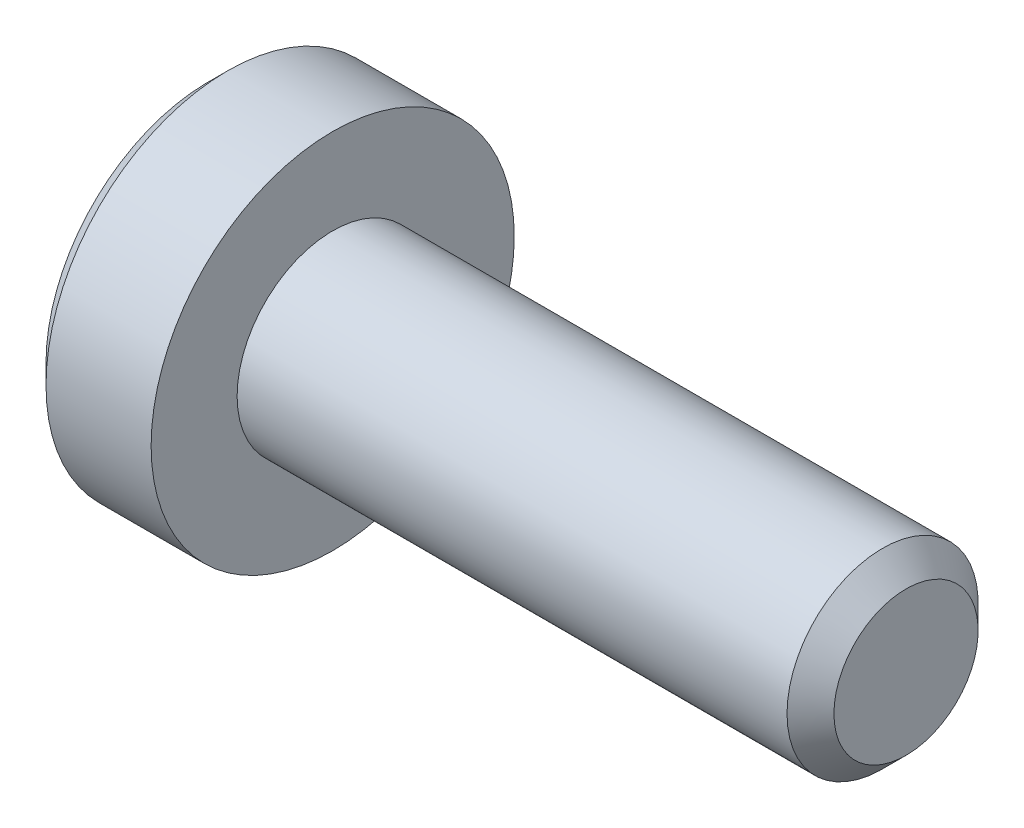
ISO-10303-21;
HEADER;
FILE_DESCRIPTION(('STEP AP214'),'2;1');
FILE_NAME('part.step','',(''),(''),'','','');
FILE_SCHEMA(('AUTOMOTIVE_DESIGN { 1 0 10303 214 1 1 1 1 }'));
ENDSEC;
DATA;
#1=APPLICATION_CONTEXT('core data for automotive mechanical design processes');
#2=APPLICATION_PROTOCOL_DEFINITION('international standard','automotive_design',2000,#1);
#3=PRODUCT_CONTEXT('',#1,'mechanical');
#4=PRODUCT('Part','Part','',(#3));
#5=PRODUCT_RELATED_PRODUCT_CATEGORY('part','',(#4));
#6=PRODUCT_DEFINITION_FORMATION('','',#4);
#7=PRODUCT_DEFINITION_CONTEXT('part definition',#1,'design');
#8=PRODUCT_DEFINITION('design','',#6,#7);
#9=PRODUCT_DEFINITION_SHAPE('','',#8);
#10=(LENGTH_UNIT() NAMED_UNIT(*) SI_UNIT(.MILLI.,.METRE.));
#11=(NAMED_UNIT(*) PLANE_ANGLE_UNIT() SI_UNIT($,.RADIAN.));
#12=(NAMED_UNIT(*) SI_UNIT($,.STERADIAN.) SOLID_ANGLE_UNIT());
#13=UNCERTAINTY_MEASURE_WITH_UNIT(LENGTH_MEASURE(1.E-05),#10,'distance_accuracy_value','');
#14=(GEOMETRIC_REPRESENTATION_CONTEXT(3) GLOBAL_UNCERTAINTY_ASSIGNED_CONTEXT((#13)) GLOBAL_UNIT_ASSIGNED_CONTEXT((#10,
#11,#12)) REPRESENTATION_CONTEXT('',''));
#15=CARTESIAN_POINT('',(0.,0.,0.));
#16=DIRECTION('',(0.,0.,1.));
#17=DIRECTION('',(1.,0.,0.));
#18=AXIS2_PLACEMENT_3D('',#15,#16,#17);
#19=CARTESIAN_POINT('',(-1.3,0.,0.));
#20=DIRECTION('',(1.,0.,0.));
#21=DIRECTION('',(0.,0.,-1.));
#22=AXIS2_PLACEMENT_3D('',#19,#20,#21);
#23=PLANE('',#22);
#24=CARTESIAN_POINT('',(-1.3,0.,0.));
#25=DIRECTION('',(-1.,0.,0.));
#26=DIRECTION('',(0.,0.,1.));
#27=AXIS2_PLACEMENT_3D('',#24,#25,#26);
#28=CIRCLE('',#27,1.7);
#29=CARTESIAN_POINT('',(-1.3,0.,1.7));
#30=VERTEX_POINT('',#29);
#31=EDGE_CURVE('E11',#30,#30,#28,.T.);
#32=ORIENTED_EDGE('',*,*,#31,.T.);
#33=EDGE_LOOP('',(#32));
#34=FACE_BOUND('',#33,.T.);
#35=DIRECTION('',(0.,-1.,0.));
#36=VECTOR('',#35,1.);
#37=CARTESIAN_POINT('',(-1.3,0.37527767497326,0.65));
#38=LINE('',#37,#36);
#39=CARTESIAN_POINT('',(-1.3,0.37527767497326,0.65));
#40=VERTEX_POINT('',#39);
#41=CARTESIAN_POINT('',(-1.3,-0.37527767497326,0.65));
#42=VERTEX_POINT('',#41);
#43=EDGE_CURVE('E49',#40,#42,#38,.T.);
#44=ORIENTED_EDGE('',*,*,#43,.T.);
#45=DIRECTION('',(0.,-0.499999999999993,-0.866025403784442));
#46=VECTOR('',#45,1.);
#47=CARTESIAN_POINT('',(-1.3,-0.37527767497326,0.65));
#48=LINE('',#47,#46);
#49=CARTESIAN_POINT('',(-1.3,-0.75055534994651,0.));
#50=VERTEX_POINT('',#49);
#51=EDGE_CURVE('E120',#42,#50,#48,.T.);
#52=ORIENTED_EDGE('',*,*,#51,.T.);
#53=DIRECTION('',(0.,0.499999999999993,-0.866025403784442));
#54=VECTOR('',#53,1.);
#55=CARTESIAN_POINT('',(-1.3,-0.75055534994651,0.));
#56=LINE('',#55,#54);
#57=CARTESIAN_POINT('',(-1.3,-0.37527767497326,-0.65));
#58=VERTEX_POINT('',#57);
#59=EDGE_CURVE('E123',#50,#58,#56,.T.);
#60=ORIENTED_EDGE('',*,*,#59,.T.);
#61=DIRECTION('',(0.,1.,0.));
#62=VECTOR('',#61,1.);
#63=CARTESIAN_POINT('',(-1.3,-0.37527767497326,-0.65));
#64=LINE('',#63,#62);
#65=CARTESIAN_POINT('',(-1.3,0.37527767497326,-0.65));
#66=VERTEX_POINT('',#65);
#67=EDGE_CURVE('E126',#58,#66,#64,.T.);
#68=ORIENTED_EDGE('',*,*,#67,.T.);
#69=DIRECTION('',(0.,0.499999999999993,0.866025403784442));
#70=VECTOR('',#69,1.);
#71=CARTESIAN_POINT('',(-1.3,0.37527767497326,-0.65));
#72=LINE('',#71,#70);
#73=CARTESIAN_POINT('',(-1.3,0.75055534994651,0.));
#74=VERTEX_POINT('',#73);
#75=EDGE_CURVE('E110',#66,#74,#72,.T.);
#76=ORIENTED_EDGE('',*,*,#75,.T.);
#77=DIRECTION('',(0.,-0.499999999999993,0.866025403784442));
#78=VECTOR('',#77,1.);
#79=CARTESIAN_POINT('',(-1.3,0.75055534994651,0.));
#80=LINE('',#79,#78);
#81=EDGE_CURVE('E129',#74,#40,#80,.T.);
#82=ORIENTED_EDGE('',*,*,#81,.T.);
#83=EDGE_LOOP('',(#44,#52,#60,#68,#76,#82));
#84=FACE_BOUND('',#83,.T.);
#85=ADVANCED_FACE('F35',(#34,#84),#23,.F.);
#86=CARTESIAN_POINT('',(-1.1,0.,0.));
#87=DIRECTION('',(1.,0.,0.));
#88=DIRECTION('',(0.,0.,-1.));
#89=AXIS2_PLACEMENT_3D('',#86,#87,#88);
#90=CONICAL_SURFACE('',#89,1.9,0.785398163397449);
#91=ORIENTED_EDGE('',*,*,#31,.F.);
#92=EDGE_LOOP('',(#91));
#93=FACE_BOUND('',#92,.T.);
#94=CARTESIAN_POINT('',(-1.1,0.,0.));
#95=DIRECTION('',(-1.,0.,0.));
#96=DIRECTION('',(0.,0.,1.));
#97=AXIS2_PLACEMENT_3D('',#94,#95,#96);
#98=CIRCLE('',#97,1.9);
#99=CARTESIAN_POINT('',(-1.1,0.,1.9));
#100=VERTEX_POINT('',#99);
#101=EDGE_CURVE('E42',#100,#100,#98,.T.);
#102=ORIENTED_EDGE('',*,*,#101,.T.);
#103=EDGE_LOOP('',(#102));
#104=FACE_BOUND('',#103,.T.);
#105=ADVANCED_FACE('F154',(#93,#104),#90,.T.);
#106=CARTESIAN_POINT('',(6.,0.,0.));
#107=DIRECTION('',(-1.,0.,0.));
#108=DIRECTION('',(0.,0.,1.));
#109=AXIS2_PLACEMENT_3D('',#106,#107,#108);
#110=CYLINDRICAL_SURFACE('',#109,1.9);
#111=ORIENTED_EDGE('',*,*,#101,.F.);
#112=EDGE_LOOP('',(#111));
#113=FACE_BOUND('',#112,.T.);
#114=CARTESIAN_POINT('',(0.,0.,0.));
#115=DIRECTION('',(-1.,0.,0.));
#116=DIRECTION('',(0.,0.,1.));
#117=AXIS2_PLACEMENT_3D('',#114,#115,#116);
#118=CIRCLE('',#117,1.9);
#119=CARTESIAN_POINT('',(0.,0.,1.9));
#120=VERTEX_POINT('',#119);
#121=EDGE_CURVE('E149',#120,#120,#118,.T.);
#122=ORIENTED_EDGE('',*,*,#121,.T.);
#123=EDGE_LOOP('',(#122));
#124=FACE_BOUND('',#123,.T.);
#125=ADVANCED_FACE('F156',(#113,#124),#110,.T.);
#126=CARTESIAN_POINT('',(0.,1.9,0.));
#127=DIRECTION('',(-1.,0.,0.));
#128=DIRECTION('',(0.,0.,1.));
#129=AXIS2_PLACEMENT_3D('',#126,#127,#128);
#130=PLANE('',#129);
#131=ORIENTED_EDGE('',*,*,#121,.F.);
#132=EDGE_LOOP('',(#131));
#133=FACE_BOUND('',#132,.T.);
#134=CARTESIAN_POINT('',(0.,0.,0.));
#135=DIRECTION('',(-1.,0.,0.));
#136=DIRECTION('',(0.,0.,1.));
#137=AXIS2_PLACEMENT_3D('',#134,#135,#136);
#138=CIRCLE('',#137,1.);
#139=CARTESIAN_POINT('',(0.,0.,1.));
#140=VERTEX_POINT('',#139);
#141=EDGE_CURVE('E146',#140,#140,#138,.T.);
#142=ORIENTED_EDGE('',*,*,#141,.T.);
#143=EDGE_LOOP('',(#142));
#144=FACE_BOUND('',#143,.T.);
#145=ADVANCED_FACE('F159',(#133,#144),#130,.F.);
#146=CARTESIAN_POINT('',(6.,0.,0.));
#147=DIRECTION('',(-1.,0.,0.));
#148=DIRECTION('',(0.,0.,1.));
#149=AXIS2_PLACEMENT_3D('',#146,#147,#148);
#150=CYLINDRICAL_SURFACE('',#149,1.);
#151=ORIENTED_EDGE('',*,*,#141,.F.);
#152=EDGE_LOOP('',(#151));
#153=FACE_BOUND('',#152,.T.);
#154=CARTESIAN_POINT('',(5.7545,0.,0.));
#155=DIRECTION('',(-1.,0.,0.));
#156=DIRECTION('',(0.,0.,1.));
#157=AXIS2_PLACEMENT_3D('',#154,#155,#156);
#158=CIRCLE('',#157,1.);
#159=CARTESIAN_POINT('',(5.7545,0.,1.));
#160=VERTEX_POINT('',#159);
#161=EDGE_CURVE('E143',#160,#160,#158,.T.);
#162=ORIENTED_EDGE('',*,*,#161,.T.);
#163=EDGE_LOOP('',(#162));
#164=FACE_BOUND('',#163,.T.);
#165=ADVANCED_FACE('F165',(#153,#164),#150,.T.);
#166=CARTESIAN_POINT('',(6.,0.,0.));
#167=DIRECTION('',(-1.,0.,0.));
#168=DIRECTION('',(0.,0.,1.));
#169=AXIS2_PLACEMENT_3D('',#166,#167,#168);
#170=CONICAL_SURFACE('',#169,0.7545,0.785398163397448);
#171=ORIENTED_EDGE('',*,*,#161,.F.);
#172=EDGE_LOOP('',(#171));
#173=FACE_BOUND('',#172,.T.);
#174=CARTESIAN_POINT('',(6.,0.,0.));
#175=DIRECTION('',(-1.,0.,0.));
#176=DIRECTION('',(0.,0.,1.));
#177=AXIS2_PLACEMENT_3D('',#174,#175,#176);
#178=CIRCLE('',#177,0.7545);
#179=CARTESIAN_POINT('',(6.,0.,0.7545));
#180=VERTEX_POINT('',#179);
#181=EDGE_CURVE('E140',#180,#180,#178,.T.);
#182=ORIENTED_EDGE('',*,*,#181,.T.);
#183=EDGE_LOOP('',(#182));
#184=FACE_BOUND('',#183,.T.);
#185=ADVANCED_FACE('F171',(#173,#184),#170,.T.);
#186=CARTESIAN_POINT('',(6.,0.7545,0.));
#187=DIRECTION('',(-1.,0.,0.));
#188=DIRECTION('',(0.,0.,1.));
#189=AXIS2_PLACEMENT_3D('',#186,#187,#188);
#190=PLANE('',#189);
#191=ORIENTED_EDGE('',*,*,#181,.F.);
#192=EDGE_LOOP('',(#191));
#193=FACE_BOUND('',#192,.T.);
#194=ADVANCED_FACE('F177',(#193),#190,.F.);
#195=CARTESIAN_POINT('',(-0.6,0.37527767497326,0.65));
#196=DIRECTION('',(0.,0.,-1.));
#197=DIRECTION('',(-1.,0.,0.));
#198=AXIS2_PLACEMENT_3D('',#195,#196,#197);
#199=PLANE('',#198);
#200=ORIENTED_EDGE('',*,*,#43,.F.);
#201=DIRECTION('',(-1.,0.,0.));
#202=VECTOR('',#201,1.);
#203=CARTESIAN_POINT('',(-0.6,0.37527767497326,0.65));
#204=LINE('',#203,#202);
#205=CARTESIAN_POINT('',(-0.6,0.37527767497326,0.65));
#206=VERTEX_POINT('',#205);
#207=EDGE_CURVE('E115',#206,#40,#204,.T.);
#208=ORIENTED_EDGE('',*,*,#207,.F.);
#209=DIRECTION('',(0.,-1.,0.));
#210=VECTOR('',#209,1.);
#211=CARTESIAN_POINT('',(-0.6,0.37527767497326,0.65));
#212=LINE('',#211,#210);
#213=CARTESIAN_POINT('',(-0.6,-0.37527767497326,0.65));
#214=VERTEX_POINT('',#213);
#215=EDGE_CURVE('E132',#206,#214,#212,.T.);
#216=ORIENTED_EDGE('',*,*,#215,.T.);
#217=DIRECTION('',(-1.,0.,0.));
#218=VECTOR('',#217,1.);
#219=CARTESIAN_POINT('',(-0.6,-0.37527767497326,0.65));
#220=LINE('',#219,#218);
#221=EDGE_CURVE('E138',#214,#42,#220,.T.);
#222=ORIENTED_EDGE('',*,*,#221,.T.);
#223=EDGE_LOOP('',(#200,#208,#216,#222));
#224=FACE_BOUND('',#223,.T.);
#225=ADVANCED_FACE('F182',(#224),#199,.T.);
#226=CARTESIAN_POINT('',(-0.6,-0.37527767497326,0.65));
#227=DIRECTION('',(0.,0.866025403784442,-0.499999999999993));
#228=DIRECTION('',(0.,0.499999999999993,0.866025403784442));
#229=AXIS2_PLACEMENT_3D('',#226,#227,#228);
#230=PLANE('',#229);
#231=ORIENTED_EDGE('',*,*,#51,.F.);
#232=ORIENTED_EDGE('',*,*,#221,.F.);
#233=DIRECTION('',(0.,-0.499999999999993,-0.866025403784442));
#234=VECTOR('',#233,1.);
#235=CARTESIAN_POINT('',(-0.6,-0.37527767497326,0.65));
#236=LINE('',#235,#234);
#237=CARTESIAN_POINT('',(-0.6,-0.75055534994651,0.));
#238=VERTEX_POINT('',#237);
#239=EDGE_CURVE('E88',#214,#238,#236,.T.);
#240=ORIENTED_EDGE('',*,*,#239,.T.);
#241=DIRECTION('',(-1.,0.,0.));
#242=VECTOR('',#241,1.);
#243=CARTESIAN_POINT('',(-0.6,-0.75055534994651,0.));
#244=LINE('',#243,#242);
#245=EDGE_CURVE('E136',#238,#50,#244,.T.);
#246=ORIENTED_EDGE('',*,*,#245,.T.);
#247=EDGE_LOOP('',(#231,#232,#240,#246));
#248=FACE_BOUND('',#247,.T.);
#249=ADVANCED_FACE('F187',(#248),#230,.T.);
#250=CARTESIAN_POINT('',(-0.6,-0.75055534994651,0.));
#251=DIRECTION('',(0.,0.866025403784442,0.499999999999993));
#252=DIRECTION('',(0.,-0.499999999999993,0.866025403784442));
#253=AXIS2_PLACEMENT_3D('',#250,#251,#252);
#254=PLANE('',#253);
#255=ORIENTED_EDGE('',*,*,#59,.F.);
#256=ORIENTED_EDGE('',*,*,#245,.F.);
#257=DIRECTION('',(0.,0.499999999999993,-0.866025403784442));
#258=VECTOR('',#257,1.);
#259=CARTESIAN_POINT('',(-0.6,-0.75055534994651,0.));
#260=LINE('',#259,#258);
#261=CARTESIAN_POINT('',(-0.6,-0.37527767497326,-0.65));
#262=VERTEX_POINT('',#261);
#263=EDGE_CURVE('E106',#238,#262,#260,.T.);
#264=ORIENTED_EDGE('',*,*,#263,.T.);
#265=DIRECTION('',(-1.,0.,0.));
#266=VECTOR('',#265,1.);
#267=CARTESIAN_POINT('',(-0.6,-0.37527767497326,-0.65));
#268=LINE('',#267,#266);
#269=EDGE_CURVE('E103',#262,#58,#268,.T.);
#270=ORIENTED_EDGE('',*,*,#269,.T.);
#271=EDGE_LOOP('',(#255,#256,#264,#270));
#272=FACE_BOUND('',#271,.T.);
#273=ADVANCED_FACE('F204',(#272),#254,.T.);
#274=CARTESIAN_POINT('',(-0.6,-0.37527767497326,-0.65));
#275=DIRECTION('',(0.,0.,1.));
#276=DIRECTION('',(1.,0.,0.));
#277=AXIS2_PLACEMENT_3D('',#274,#275,#276);
#278=PLANE('',#277);
#279=ORIENTED_EDGE('',*,*,#67,.F.);
#280=ORIENTED_EDGE('',*,*,#269,.F.);
#281=DIRECTION('',(0.,1.,0.));
#282=VECTOR('',#281,1.);
#283=CARTESIAN_POINT('',(-0.6,-0.37527767497326,-0.65));
#284=LINE('',#283,#282);
#285=CARTESIAN_POINT('',(-0.6,0.37527767497326,-0.65));
#286=VERTEX_POINT('',#285);
#287=EDGE_CURVE('E98',#262,#286,#284,.T.);
#288=ORIENTED_EDGE('',*,*,#287,.T.);
#289=DIRECTION('',(-1.,0.,0.));
#290=VECTOR('',#289,1.);
#291=CARTESIAN_POINT('',(-0.6,0.37527767497326,-0.65));
#292=LINE('',#291,#290);
#293=EDGE_CURVE('E102',#286,#66,#292,.T.);
#294=ORIENTED_EDGE('',*,*,#293,.T.);
#295=EDGE_LOOP('',(#279,#280,#288,#294));
#296=FACE_BOUND('',#295,.T.);
#297=ADVANCED_FACE('F101',(#296),#278,.T.);
#298=CARTESIAN_POINT('',(-0.6,0.37527767497326,-0.65));
#299=DIRECTION('',(0.,-0.866025403784442,0.499999999999993));
#300=DIRECTION('',(0.,-0.499999999999993,-0.866025403784442));
#301=AXIS2_PLACEMENT_3D('',#298,#299,#300);
#302=PLANE('',#301);
#303=ORIENTED_EDGE('',*,*,#75,.F.);
#304=ORIENTED_EDGE('',*,*,#293,.F.);
#305=DIRECTION('',(0.,0.499999999999993,0.866025403784442));
#306=VECTOR('',#305,1.);
#307=CARTESIAN_POINT('',(-0.6,0.37527767497326,-0.65));
#308=LINE('',#307,#306);
#309=CARTESIAN_POINT('',(-0.6,0.75055534994651,0.));
#310=VERTEX_POINT('',#309);
#311=EDGE_CURVE('E105',#286,#310,#308,.T.);
#312=ORIENTED_EDGE('',*,*,#311,.T.);
#313=DIRECTION('',(-1.,0.,0.));
#314=VECTOR('',#313,1.);
#315=CARTESIAN_POINT('',(-0.6,0.75055534994651,0.));
#316=LINE('',#315,#314);
#317=EDGE_CURVE('E79',#310,#74,#316,.T.);
#318=ORIENTED_EDGE('',*,*,#317,.T.);
#319=EDGE_LOOP('',(#303,#304,#312,#318));
#320=FACE_BOUND('',#319,.T.);
#321=ADVANCED_FACE('F108',(#320),#302,.T.);
#322=CARTESIAN_POINT('',(-0.6,0.75055534994651,0.));
#323=DIRECTION('',(0.,-0.866025403784442,-0.499999999999993));
#324=DIRECTION('',(0.,0.499999999999993,-0.866025403784442));
#325=AXIS2_PLACEMENT_3D('',#322,#323,#324);
#326=PLANE('',#325);
#327=ORIENTED_EDGE('',*,*,#81,.F.);
#328=ORIENTED_EDGE('',*,*,#317,.F.);
#329=DIRECTION('',(0.,-0.499999999999993,0.866025403784442));
#330=VECTOR('',#329,1.);
#331=CARTESIAN_POINT('',(-0.6,0.75055534994651,0.));
#332=LINE('',#331,#330);
#333=EDGE_CURVE('E57',#310,#206,#332,.T.);
#334=ORIENTED_EDGE('',*,*,#333,.T.);
#335=ORIENTED_EDGE('',*,*,#207,.T.);
#336=EDGE_LOOP('',(#327,#328,#334,#335));
#337=FACE_BOUND('',#336,.T.);
#338=ADVANCED_FACE('F197',(#337),#326,.T.);
#339=CARTESIAN_POINT('',(-0.6,0.,0.));
#340=DIRECTION('',(1.,0.,0.));
#341=DIRECTION('',(0.,0.,-1.));
#342=AXIS2_PLACEMENT_3D('',#339,#340,#341);
#343=PLANE('',#342);
#344=ORIENTED_EDGE('',*,*,#215,.F.);
#345=ORIENTED_EDGE('',*,*,#333,.F.);
#346=ORIENTED_EDGE('',*,*,#311,.F.);
#347=ORIENTED_EDGE('',*,*,#287,.F.);
#348=ORIENTED_EDGE('',*,*,#263,.F.);
#349=ORIENTED_EDGE('',*,*,#239,.F.);
#350=EDGE_LOOP('',(#344,#345,#346,#347,#348,#349));
#351=FACE_BOUND('',#350,.T.);
#352=ADVANCED_FACE('F113',(#351),#343,.F.);
#353=CLOSED_SHELL('',(#85,#105,#125,#145,#165,#185,#194,#225,#249,#273,#297,#321,#338,#352));
#354=MANIFOLD_SOLID_BREP('B2',#353);
#355=ADVANCED_BREP_SHAPE_REPRESENTATION('',(#18,#354),#14);
#356=SHAPE_DEFINITION_REPRESENTATION(#9,#355);
ENDSEC;
END-ISO-10303-21;
